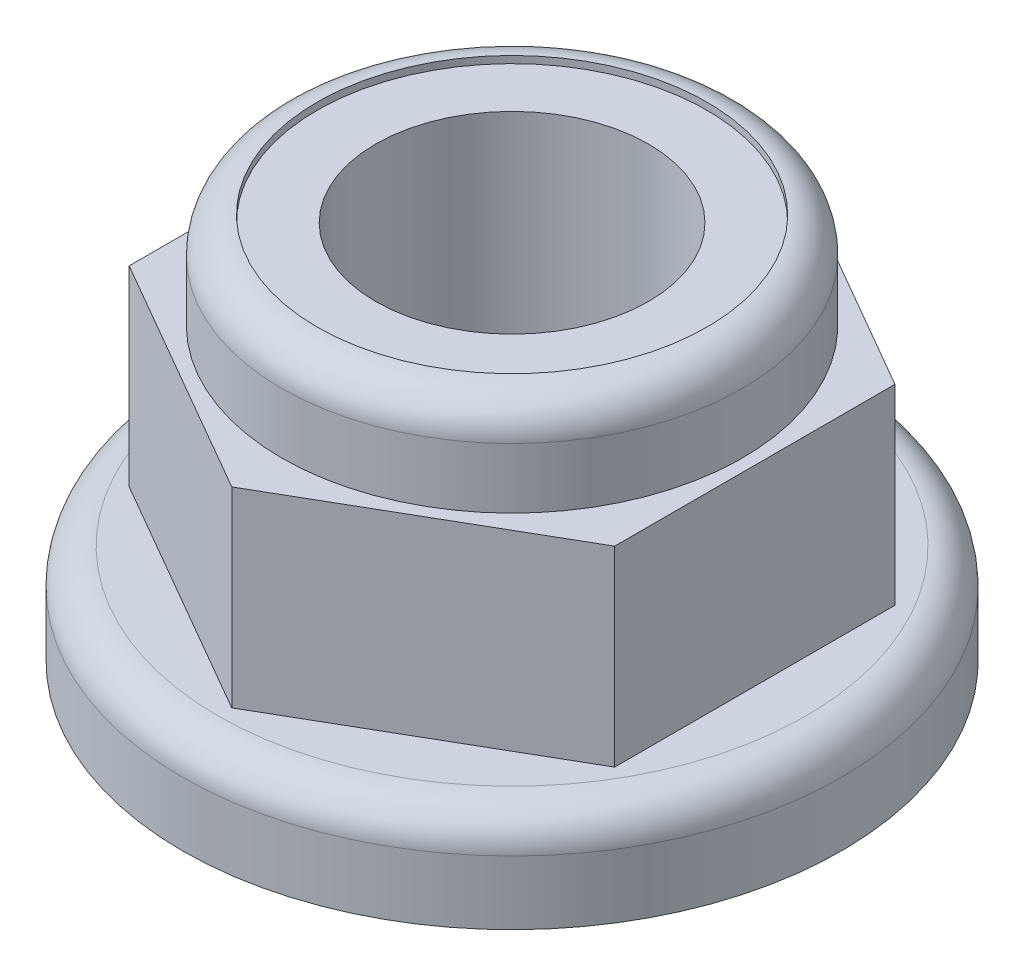
ISO-10303-21;
HEADER;
FILE_DESCRIPTION(('STEP AP214'),'2;1');
FILE_NAME('part.step','',(''),(''),'','','');
FILE_SCHEMA(('AUTOMOTIVE_DESIGN { 1 0 10303 214 1 1 1 1 }'));
ENDSEC;
DATA;
#1=APPLICATION_CONTEXT('core data for automotive mechanical design processes');
#2=APPLICATION_PROTOCOL_DEFINITION('international standard','automotive_design',2000,#1);
#3=PRODUCT_CONTEXT('',#1,'mechanical');
#4=PRODUCT('Part','Part','',(#3));
#5=PRODUCT_RELATED_PRODUCT_CATEGORY('part','',(#4));
#6=PRODUCT_DEFINITION_FORMATION('','',#4);
#7=PRODUCT_DEFINITION_CONTEXT('part definition',#1,'design');
#8=PRODUCT_DEFINITION('design','',#6,#7);
#9=PRODUCT_DEFINITION_SHAPE('','',#8);
#10=(LENGTH_UNIT() NAMED_UNIT(*) SI_UNIT(.MILLI.,.METRE.));
#11=(NAMED_UNIT(*) PLANE_ANGLE_UNIT() SI_UNIT($,.RADIAN.));
#12=(NAMED_UNIT(*) SI_UNIT($,.STERADIAN.) SOLID_ANGLE_UNIT());
#13=UNCERTAINTY_MEASURE_WITH_UNIT(LENGTH_MEASURE(1.E-05),#10,'distance_accuracy_value','');
#14=(GEOMETRIC_REPRESENTATION_CONTEXT(3) GLOBAL_UNCERTAINTY_ASSIGNED_CONTEXT((#13)) GLOBAL_UNIT_ASSIGNED_CONTEXT((#10,
#11,#12)) REPRESENTATION_CONTEXT('',''));
#15=CARTESIAN_POINT('',(0.,0.,0.));
#16=DIRECTION('',(0.,0.,1.));
#17=DIRECTION('',(1.,0.,0.));
#18=AXIS2_PLACEMENT_3D('',#15,#16,#17);
#19=CARTESIAN_POINT('',(0.,-0.00100000000000013,0.));
#20=DIRECTION('',(0.,1.,0.));
#21=DIRECTION('',(0.,0.,1.));
#22=AXIS2_PLACEMENT_3D('',#19,#20,#21);
#23=CYLINDRICAL_SURFACE('',#22,1.925);
#24=CARTESIAN_POINT('',(0.,0.,0.));
#25=DIRECTION('',(0.,1.,0.));
#26=DIRECTION('',(0.,0.,1.));
#27=AXIS2_PLACEMENT_3D('',#24,#25,#26);
#28=CIRCLE('',#27,1.925);
#29=CARTESIAN_POINT('',(0.,0.,1.925));
#30=VERTEX_POINT('',#29);
#31=EDGE_CURVE('E288',#30,#30,#28,.F.);
#32=ORIENTED_EDGE('',*,*,#31,.T.);
#33=EDGE_LOOP('',(#32));
#34=FACE_BOUND('',#33,.T.);
#35=CARTESIAN_POINT('',(0.,5.35,0.));
#36=DIRECTION('',(0.,1.,0.));
#37=DIRECTION('',(0.,0.,1.));
#38=AXIS2_PLACEMENT_3D('',#35,#36,#37);
#39=CIRCLE('',#38,1.925);
#40=CARTESIAN_POINT('',(0.,5.35,1.925));
#41=VERTEX_POINT('',#40);
#42=EDGE_CURVE('E284',#41,#41,#39,.T.);
#43=ORIENTED_EDGE('',*,*,#42,.T.);
#44=EDGE_LOOP('',(#43));
#45=FACE_BOUND('',#44,.T.);
#46=ADVANCED_FACE('F34',(#34,#45),#23,.F.);
#47=CARTESIAN_POINT('',(0.,1.4,0.));
#48=DIRECTION('',(0.,1.,0.));
#49=DIRECTION('',(0.,0.,1.));
#50=AXIS2_PLACEMENT_3D('',#47,#48,#49);
#51=PLANE('',#50);
#52=CARTESIAN_POINT('',(0.,1.4,0.));
#53=DIRECTION('',(0.,1.,0.));
#54=DIRECTION('',(0.,0.,1.));
#55=AXIS2_PLACEMENT_3D('',#52,#53,#54);
#56=CIRCLE('',#55,4.15);
#57=CARTESIAN_POINT('',(0.,1.4,4.15));
#58=VERTEX_POINT('',#57);
#59=EDGE_CURVE('E42',#58,#58,#56,.T.);
#60=ORIENTED_EDGE('',*,*,#59,.T.);
#61=EDGE_LOOP('',(#60));
#62=FACE_BOUND('',#61,.T.);
#63=DIRECTION('',(0.866025403784438,0.,-0.5));
#64=VECTOR('',#63,1.);
#65=CARTESIAN_POINT('',(0.,1.4,3.95484934394894));
#66=LINE('',#65,#64);
#67=CARTESIAN_POINT('',(0.,1.4,3.95484934394894));
#68=VERTEX_POINT('',#67);
#69=CARTESIAN_POINT('',(3.425,1.4,1.97742467197447));
#70=VERTEX_POINT('',#69);
#71=EDGE_CURVE('E121',#68,#70,#66,.T.);
#72=ORIENTED_EDGE('',*,*,#71,.F.);
#73=DIRECTION('',(0.866025403784438,0.,0.5));
#74=VECTOR('',#73,1.);
#75=CARTESIAN_POINT('',(-3.425,1.4,1.97742467197447));
#76=LINE('',#75,#74);
#77=CARTESIAN_POINT('',(-3.425,1.4,1.97742467197447));
#78=VERTEX_POINT('',#77);
#79=EDGE_CURVE('E118',#78,#68,#76,.T.);
#80=ORIENTED_EDGE('',*,*,#79,.F.);
#81=DIRECTION('',(0.,0.,1.));
#82=VECTOR('',#81,1.);
#83=CARTESIAN_POINT('',(-3.425,1.4,-1.97742467197447));
#84=LINE('',#83,#82);
#85=CARTESIAN_POINT('',(-3.425,1.4,-1.97742467197447));
#86=VERTEX_POINT('',#85);
#87=EDGE_CURVE('E77',#86,#78,#84,.T.);
#88=ORIENTED_EDGE('',*,*,#87,.F.);
#89=DIRECTION('',(-0.866025403784439,0.,0.5));
#90=VECTOR('',#89,1.);
#91=CARTESIAN_POINT('',(0.,1.4,-3.95484934394894));
#92=LINE('',#91,#90);
#93=CARTESIAN_POINT('',(0.,1.4,-3.95484934394894));
#94=VERTEX_POINT('',#93);
#95=EDGE_CURVE('E127',#94,#86,#92,.T.);
#96=ORIENTED_EDGE('',*,*,#95,.F.);
#97=DIRECTION('',(-0.866025403784439,0.,-0.5));
#98=VECTOR('',#97,1.);
#99=CARTESIAN_POINT('',(3.425,1.4,-1.97742467197447));
#100=LINE('',#99,#98);
#101=CARTESIAN_POINT('',(3.425,1.4,-1.97742467197447));
#102=VERTEX_POINT('',#101);
#103=EDGE_CURVE('E107',#102,#94,#100,.T.);
#104=ORIENTED_EDGE('',*,*,#103,.F.);
#105=DIRECTION('',(0.,0.,-1.));
#106=VECTOR('',#105,1.);
#107=CARTESIAN_POINT('',(3.425,1.4,1.97742467197447));
#108=LINE('',#107,#106);
#109=EDGE_CURVE('E124',#70,#102,#108,.T.);
#110=ORIENTED_EDGE('',*,*,#109,.F.);
#111=EDGE_LOOP('',(#72,#80,#88,#96,#104,#110));
#112=FACE_BOUND('',#111,.T.);
#113=ADVANCED_FACE('F147',(#62,#112),#51,.T.);
#114=CARTESIAN_POINT('',(0.,1.4,0.));
#115=DIRECTION('',(0.,-1.,0.));
#116=DIRECTION('',(0.,0.,-1.));
#117=AXIS2_PLACEMENT_3D('',#114,#115,#116);
#118=CYLINDRICAL_SURFACE('',#117,4.65);
#119=CARTESIAN_POINT('',(0.,0.9,0.));
#120=DIRECTION('',(0.,1.,0.));
#121=DIRECTION('',(0.,0.,1.));
#122=AXIS2_PLACEMENT_3D('',#119,#120,#121);
#123=CIRCLE('',#122,4.65);
#124=CARTESIAN_POINT('',(0.,0.9,4.65));
#125=VERTEX_POINT('',#124);
#126=EDGE_CURVE('E11',#125,#125,#123,.F.);
#127=ORIENTED_EDGE('',*,*,#126,.T.);
#128=EDGE_LOOP('',(#127));
#129=FACE_BOUND('',#128,.T.);
#130=CARTESIAN_POINT('',(0.,0.,0.));
#131=DIRECTION('',(0.,1.,0.));
#132=DIRECTION('',(0.,0.,1.));
#133=AXIS2_PLACEMENT_3D('',#130,#131,#132);
#134=CIRCLE('',#133,4.65);
#135=CARTESIAN_POINT('',(0.,0.,4.65));
#136=VERTEX_POINT('',#135);
#137=EDGE_CURVE('E139',#136,#136,#134,.T.);
#138=ORIENTED_EDGE('',*,*,#137,.T.);
#139=EDGE_LOOP('',(#138));
#140=FACE_BOUND('',#139,.T.);
#141=ADVANCED_FACE('F170',(#129,#140),#118,.T.);
#142=CARTESIAN_POINT('',(0.,0.,0.));
#143=DIRECTION('',(0.,1.,0.));
#144=DIRECTION('',(0.,0.,1.));
#145=AXIS2_PLACEMENT_3D('',#142,#143,#144);
#146=PLANE('',#145);
#147=ORIENTED_EDGE('',*,*,#31,.F.);
#148=EDGE_LOOP('',(#147));
#149=FACE_BOUND('',#148,.T.);
#150=ORIENTED_EDGE('',*,*,#137,.F.);
#151=EDGE_LOOP('',(#150));
#152=FACE_BOUND('',#151,.T.);
#153=ADVANCED_FACE('F198',(#149,#152),#146,.F.);
#154=CARTESIAN_POINT('',(-3.425,4.1,1.97742467197447));
#155=DIRECTION('',(0.5,0.,-0.866025403784438));
#156=DIRECTION('',(-0.866025403784439,0.,-0.5));
#157=AXIS2_PLACEMENT_3D('',#154,#155,#156);
#158=PLANE('',#157);
#159=ORIENTED_EDGE('',*,*,#79,.T.);
#160=DIRECTION('',(0.,-1.,0.));
#161=VECTOR('',#160,1.);
#162=CARTESIAN_POINT('',(0.,4.1,3.95484934394894));
#163=LINE('',#162,#161);
#164=CARTESIAN_POINT('',(0.,4.1,3.95484934394894));
#165=VERTEX_POINT('',#164);
#166=EDGE_CURVE('E137',#165,#68,#163,.T.);
#167=ORIENTED_EDGE('',*,*,#166,.F.);
#168=DIRECTION('',(0.866025403784438,0.,0.5));
#169=VECTOR('',#168,1.);
#170=CARTESIAN_POINT('',(-3.425,4.1,1.97742467197447));
#171=LINE('',#170,#169);
#172=CARTESIAN_POINT('',(-3.425,4.1,1.97742467197447));
#173=VERTEX_POINT('',#172);
#174=EDGE_CURVE('E130',#173,#165,#171,.T.);
#175=ORIENTED_EDGE('',*,*,#174,.F.);
#176=DIRECTION('',(0.,-1.,0.));
#177=VECTOR('',#176,1.);
#178=CARTESIAN_POINT('',(-3.425,4.1,1.97742467197447));
#179=LINE('',#178,#177);
#180=EDGE_CURVE('E114',#173,#78,#179,.T.);
#181=ORIENTED_EDGE('',*,*,#180,.T.);
#182=EDGE_LOOP('',(#159,#167,#175,#181));
#183=FACE_BOUND('',#182,.T.);
#184=ADVANCED_FACE('F196',(#183),#158,.F.);
#185=CARTESIAN_POINT('',(0.,4.1,3.95484934394894));
#186=DIRECTION('',(-0.5,0.,-0.866025403784438));
#187=DIRECTION('',(-0.866025403784438,0.,0.5));
#188=AXIS2_PLACEMENT_3D('',#185,#186,#187);
#189=PLANE('',#188);
#190=ORIENTED_EDGE('',*,*,#71,.T.);
#191=DIRECTION('',(0.,-1.,0.));
#192=VECTOR('',#191,1.);
#193=CARTESIAN_POINT('',(3.425,4.1,1.97742467197447));
#194=LINE('',#193,#192);
#195=CARTESIAN_POINT('',(3.425,4.1,1.97742467197447));
#196=VERTEX_POINT('',#195);
#197=EDGE_CURVE('E134',#196,#70,#194,.T.);
#198=ORIENTED_EDGE('',*,*,#197,.F.);
#199=DIRECTION('',(0.866025403784438,0.,-0.5));
#200=VECTOR('',#199,1.);
#201=CARTESIAN_POINT('',(0.,4.1,3.95484934394894));
#202=LINE('',#201,#200);
#203=EDGE_CURVE('E85',#165,#196,#202,.T.);
#204=ORIENTED_EDGE('',*,*,#203,.F.);
#205=ORIENTED_EDGE('',*,*,#166,.T.);
#206=EDGE_LOOP('',(#190,#198,#204,#205));
#207=FACE_BOUND('',#206,.T.);
#208=ADVANCED_FACE('F192',(#207),#189,.F.);
#209=CARTESIAN_POINT('',(3.425,4.1,1.97742467197447));
#210=DIRECTION('',(-1.,0.,0.));
#211=DIRECTION('',(0.,0.,1.));
#212=AXIS2_PLACEMENT_3D('',#209,#210,#211);
#213=PLANE('',#212);
#214=ORIENTED_EDGE('',*,*,#109,.T.);
#215=DIRECTION('',(0.,-1.,0.));
#216=VECTOR('',#215,1.);
#217=CARTESIAN_POINT('',(3.425,4.1,-1.97742467197447));
#218=LINE('',#217,#216);
#219=CARTESIAN_POINT('',(3.425,4.1,-1.97742467197447));
#220=VERTEX_POINT('',#219);
#221=EDGE_CURVE('E110',#220,#102,#218,.T.);
#222=ORIENTED_EDGE('',*,*,#221,.F.);
#223=DIRECTION('',(0.,0.,-1.));
#224=VECTOR('',#223,1.);
#225=CARTESIAN_POINT('',(3.425,4.1,1.97742467197447));
#226=LINE('',#225,#224);
#227=EDGE_CURVE('E98',#196,#220,#226,.T.);
#228=ORIENTED_EDGE('',*,*,#227,.F.);
#229=ORIENTED_EDGE('',*,*,#197,.T.);
#230=EDGE_LOOP('',(#214,#222,#228,#229));
#231=FACE_BOUND('',#230,.T.);
#232=ADVANCED_FACE('F189',(#231),#213,.F.);
#233=CARTESIAN_POINT('',(3.425,4.1,-1.97742467197447));
#234=DIRECTION('',(-0.5,0.,0.866025403784439));
#235=DIRECTION('',(0.866025403784439,0.,0.5));
#236=AXIS2_PLACEMENT_3D('',#233,#234,#235);
#237=PLANE('',#236);
#238=ORIENTED_EDGE('',*,*,#103,.T.);
#239=DIRECTION('',(0.,-1.,0.));
#240=VECTOR('',#239,1.);
#241=CARTESIAN_POINT('',(0.,4.1,-3.95484934394894));
#242=LINE('',#241,#240);
#243=CARTESIAN_POINT('',(0.,4.1,-3.95484934394894));
#244=VERTEX_POINT('',#243);
#245=EDGE_CURVE('E104',#244,#94,#242,.T.);
#246=ORIENTED_EDGE('',*,*,#245,.F.);
#247=DIRECTION('',(-0.866025403784439,0.,-0.5));
#248=VECTOR('',#247,1.);
#249=CARTESIAN_POINT('',(3.425,4.1,-1.97742467197447));
#250=LINE('',#249,#248);
#251=EDGE_CURVE('E92',#220,#244,#250,.T.);
#252=ORIENTED_EDGE('',*,*,#251,.F.);
#253=ORIENTED_EDGE('',*,*,#221,.T.);
#254=EDGE_LOOP('',(#238,#246,#252,#253));
#255=FACE_BOUND('',#254,.T.);
#256=ADVANCED_FACE('F105',(#255),#237,.F.);
#257=CARTESIAN_POINT('',(0.,4.1,-3.95484934394894));
#258=DIRECTION('',(0.5,0.,0.866025403784439));
#259=DIRECTION('',(0.866025403784439,0.,-0.5));
#260=AXIS2_PLACEMENT_3D('',#257,#258,#259);
#261=PLANE('',#260);
#262=ORIENTED_EDGE('',*,*,#95,.T.);
#263=DIRECTION('',(0.,-1.,0.));
#264=VECTOR('',#263,1.);
#265=CARTESIAN_POINT('',(-3.425,4.1,-1.97742467197447));
#266=LINE('',#265,#264);
#267=CARTESIAN_POINT('',(-3.425,4.1,-1.97742467197447));
#268=VERTEX_POINT('',#267);
#269=EDGE_CURVE('E49',#268,#86,#266,.T.);
#270=ORIENTED_EDGE('',*,*,#269,.F.);
#271=DIRECTION('',(-0.866025403784439,0.,0.5));
#272=VECTOR('',#271,1.);
#273=CARTESIAN_POINT('',(0.,4.1,-3.95484934394894));
#274=LINE('',#273,#272);
#275=EDGE_CURVE('E96',#244,#268,#274,.T.);
#276=ORIENTED_EDGE('',*,*,#275,.F.);
#277=ORIENTED_EDGE('',*,*,#245,.T.);
#278=EDGE_LOOP('',(#262,#270,#276,#277));
#279=FACE_BOUND('',#278,.T.);
#280=ADVANCED_FACE('F112',(#279),#261,.F.);
#281=CARTESIAN_POINT('',(-3.425,4.1,-1.97742467197447));
#282=DIRECTION('',(1.,0.,0.));
#283=DIRECTION('',(0.,0.,-1.));
#284=AXIS2_PLACEMENT_3D('',#281,#282,#283);
#285=PLANE('',#284);
#286=ORIENTED_EDGE('',*,*,#87,.T.);
#287=ORIENTED_EDGE('',*,*,#180,.F.);
#288=DIRECTION('',(0.,0.,1.));
#289=VECTOR('',#288,1.);
#290=CARTESIAN_POINT('',(-3.425,4.1,-1.97742467197447));
#291=LINE('',#290,#289);
#292=EDGE_CURVE('E57',#268,#173,#291,.T.);
#293=ORIENTED_EDGE('',*,*,#292,.F.);
#294=ORIENTED_EDGE('',*,*,#269,.T.);
#295=EDGE_LOOP('',(#286,#287,#293,#294));
#296=FACE_BOUND('',#295,.T.);
#297=ADVANCED_FACE('F181',(#296),#285,.F.);
#298=CARTESIAN_POINT('',(0.,4.1,0.));
#299=DIRECTION('',(0.,1.,0.));
#300=DIRECTION('',(0.,0.,1.));
#301=AXIS2_PLACEMENT_3D('',#298,#299,#300);
#302=PLANE('',#301);
#303=CARTESIAN_POINT('',(0.,4.1,0.));
#304=DIRECTION('',(0.,1.,0.));
#305=DIRECTION('',(0.,0.,1.));
#306=AXIS2_PLACEMENT_3D('',#303,#304,#305);
#307=CIRCLE('',#306,3.25);
#308=CARTESIAN_POINT('',(0.,4.1,3.25));
#309=VERTEX_POINT('',#308);
#310=EDGE_CURVE('E122',#309,#309,#307,.T.);
#311=ORIENTED_EDGE('',*,*,#310,.F.);
#312=EDGE_LOOP('',(#311));
#313=FACE_BOUND('',#312,.T.);
#314=ORIENTED_EDGE('',*,*,#174,.T.);
#315=ORIENTED_EDGE('',*,*,#203,.T.);
#316=ORIENTED_EDGE('',*,*,#227,.T.);
#317=ORIENTED_EDGE('',*,*,#251,.T.);
#318=ORIENTED_EDGE('',*,*,#275,.T.);
#319=ORIENTED_EDGE('',*,*,#292,.T.);
#320=EDGE_LOOP('',(#314,#315,#316,#317,#318,#319));
#321=FACE_BOUND('',#320,.T.);
#322=ADVANCED_FACE('F94',(#313,#321),#302,.T.);
#323=CARTESIAN_POINT('',(0.,5.45,0.));
#324=DIRECTION('',(0.,-1.,0.));
#325=DIRECTION('',(0.,0.,-1.));
#326=AXIS2_PLACEMENT_3D('',#323,#324,#325);
#327=CYLINDRICAL_SURFACE('',#326,3.25);
#328=CARTESIAN_POINT('',(0.,4.95,0.));
#329=DIRECTION('',(0.,1.,0.));
#330=DIRECTION('',(0.,0.,1.));
#331=AXIS2_PLACEMENT_3D('',#328,#329,#330);
#332=CIRCLE('',#331,3.25);
#333=CARTESIAN_POINT('',(0.,4.95,3.25));
#334=VERTEX_POINT('',#333);
#335=EDGE_CURVE('E142',#334,#334,#332,.F.);
#336=ORIENTED_EDGE('',*,*,#335,.T.);
#337=EDGE_LOOP('',(#336));
#338=FACE_BOUND('',#337,.T.);
#339=ORIENTED_EDGE('',*,*,#310,.T.);
#340=EDGE_LOOP('',(#339));
#341=FACE_BOUND('',#340,.T.);
#342=ADVANCED_FACE('F161',(#338,#341),#327,.T.);
#343=CARTESIAN_POINT('',(0.,4.95,0.));
#344=DIRECTION('',(0.,1.,0.));
#345=DIRECTION('',(0.,0.,1.));
#346=AXIS2_PLACEMENT_3D('',#343,#344,#345);
#347=TOROIDAL_SURFACE('',#346,2.75,0.5);
#348=ORIENTED_EDGE('',*,*,#335,.F.);
#349=EDGE_LOOP('',(#348));
#350=FACE_BOUND('',#349,.T.);
#351=CARTESIAN_POINT('',(0.,5.45,0.));
#352=DIRECTION('',(0.,1.,0.));
#353=DIRECTION('',(0.,0.,1.));
#354=AXIS2_PLACEMENT_3D('',#351,#352,#353);
#355=CIRCLE('',#354,2.75);
#356=CARTESIAN_POINT('',(0.,5.45,2.75));
#357=VERTEX_POINT('',#356);
#358=EDGE_CURVE('E289',#357,#357,#355,.T.);
#359=ORIENTED_EDGE('',*,*,#358,.F.);
#360=EDGE_LOOP('',(#359));
#361=FACE_BOUND('',#360,.T.);
#362=ADVANCED_FACE('F152',(#350,#361),#347,.T.);
#363=CARTESIAN_POINT('',(0.,0.9,0.));
#364=DIRECTION('',(0.,1.,0.));
#365=DIRECTION('',(0.,0.,1.));
#366=AXIS2_PLACEMENT_3D('',#363,#364,#365);
#367=TOROIDAL_SURFACE('',#366,4.15,0.5);
#368=ORIENTED_EDGE('',*,*,#126,.F.);
#369=EDGE_LOOP('',(#368));
#370=FACE_BOUND('',#369,.T.);
#371=ORIENTED_EDGE('',*,*,#59,.F.);
#372=EDGE_LOOP('',(#371));
#373=FACE_BOUND('',#372,.T.);
#374=ADVANCED_FACE('F36',(#370,#373),#367,.T.);
#375=CARTESIAN_POINT('',(0.,5.35,0.));
#376=DIRECTION('',(0.,1.,0.));
#377=DIRECTION('',(0.,0.,1.));
#378=AXIS2_PLACEMENT_3D('',#375,#376,#377);
#379=CYLINDRICAL_SURFACE('',#378,2.75);
#380=CARTESIAN_POINT('',(0.,5.35,0.));
#381=DIRECTION('',(0.,1.,0.));
#382=DIRECTION('',(0.,0.,1.));
#383=AXIS2_PLACEMENT_3D('',#380,#381,#382);
#384=CIRCLE('',#383,2.75);
#385=CARTESIAN_POINT('',(0.,5.35,2.75));
#386=VERTEX_POINT('',#385);
#387=EDGE_CURVE('E287',#386,#386,#384,.T.);
#388=ORIENTED_EDGE('',*,*,#387,.F.);
#389=EDGE_LOOP('',(#388));
#390=FACE_BOUND('',#389,.T.);
#391=ORIENTED_EDGE('',*,*,#358,.T.);
#392=EDGE_LOOP('',(#391));
#393=FACE_BOUND('',#392,.T.);
#394=ADVANCED_FACE('F151',(#390,#393),#379,.F.);
#395=CARTESIAN_POINT('',(0.,5.35,0.));
#396=DIRECTION('',(0.,1.,0.));
#397=DIRECTION('',(0.,0.,1.));
#398=AXIS2_PLACEMENT_3D('',#395,#396,#397);
#399=PLANE('',#398);
#400=ORIENTED_EDGE('',*,*,#42,.F.);
#401=EDGE_LOOP('',(#400));
#402=FACE_BOUND('',#401,.T.);
#403=ORIENTED_EDGE('',*,*,#387,.T.);
#404=EDGE_LOOP('',(#403));
#405=FACE_BOUND('',#404,.T.);
#406=ADVANCED_FACE('F158',(#402,#405),#399,.T.);
#407=CLOSED_SHELL('',(#46,#113,#141,#153,#184,#208,#232,#256,#280,#297,#322,#342,#362,#374,#394,#406));
#408=MANIFOLD_SOLID_BREP('B2',#407);
#409=ADVANCED_BREP_SHAPE_REPRESENTATION('',(#18,#408),#14);
#410=SHAPE_DEFINITION_REPRESENTATION(#9,#409);
ENDSEC;
END-ISO-10303-21;
